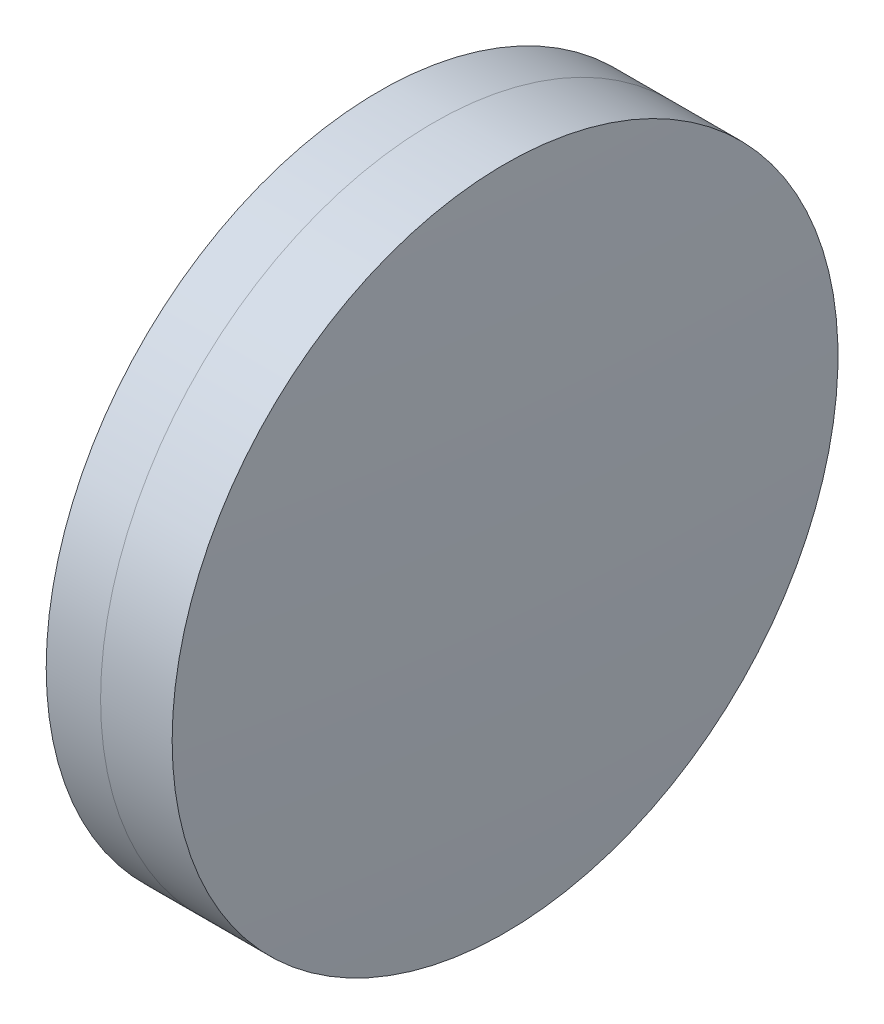
ISO-10303-21;
HEADER;
FILE_DESCRIPTION(('STEP AP214'),'2;1');
FILE_NAME('part.step','',(''),(''),'','','');
FILE_SCHEMA(('AUTOMOTIVE_DESIGN { 1 0 10303 214 1 1 1 1 }'));
ENDSEC;
DATA;
#1=APPLICATION_CONTEXT('core data for automotive mechanical design processes');
#2=APPLICATION_PROTOCOL_DEFINITION('international standard','automotive_design',2000,#1);
#3=PRODUCT_CONTEXT('',#1,'mechanical');
#4=PRODUCT('Part','Part','',(#3));
#5=PRODUCT_RELATED_PRODUCT_CATEGORY('part','',(#4));
#6=PRODUCT_DEFINITION_FORMATION('','',#4);
#7=PRODUCT_DEFINITION_CONTEXT('part definition',#1,'design');
#8=PRODUCT_DEFINITION('design','',#6,#7);
#9=PRODUCT_DEFINITION_SHAPE('','',#8);
#10=(LENGTH_UNIT() NAMED_UNIT(*) SI_UNIT(.MILLI.,.METRE.));
#11=(NAMED_UNIT(*) PLANE_ANGLE_UNIT() SI_UNIT($,.RADIAN.));
#12=(NAMED_UNIT(*) SI_UNIT($,.STERADIAN.) SOLID_ANGLE_UNIT());
#13=UNCERTAINTY_MEASURE_WITH_UNIT(LENGTH_MEASURE(1.E-05),#10,'distance_accuracy_value','');
#14=(GEOMETRIC_REPRESENTATION_CONTEXT(3) GLOBAL_UNCERTAINTY_ASSIGNED_CONTEXT((#13)) GLOBAL_UNIT_ASSIGNED_CONTEXT((#10,
#11,#12)) REPRESENTATION_CONTEXT('',''));
#15=CARTESIAN_POINT('',(0.,0.,0.));
#16=DIRECTION('',(0.,0.,1.));
#17=DIRECTION('',(1.,0.,0.));
#18=AXIS2_PLACEMENT_3D('',#15,#16,#17);
#19=CARTESIAN_POINT('',(14.8796689735747,0.,0.));
#20=DIRECTION('',(-1.,0.,0.));
#21=DIRECTION('',(0.,0.,1.));
#22=AXIS2_PLACEMENT_3D('',#19,#20,#21);
#23=SPHERICAL_SURFACE('',#22,80.015);
#24=CARTESIAN_POINT('',(93.9122586122801,0.,0.));
#25=DIRECTION('',(-1.,0.,0.));
#26=DIRECTION('',(0.,0.,1.));
#27=AXIS2_PLACEMENT_3D('',#24,#25,#26);
#28=CIRCLE('',#27,12.5000000000001);
#29=CARTESIAN_POINT('',(93.9122586122801,0.,12.5000000000001));
#30=VERTEX_POINT('',#29);
#31=EDGE_CURVE('E11',#30,#30,#28,.T.);
#32=ORIENTED_EDGE('',*,*,#31,.T.);
#33=EDGE_LOOP('',(#32));
#34=FACE_BOUND('',#33,.T.);
#35=ADVANCED_FACE('F53',(#34),#23,.F.);
#36=CARTESIAN_POINT('',(-0.551919992657797,0.,0.));
#37=DIRECTION('',(-1.,0.,0.));
#38=DIRECTION('',(0.,0.,1.));
#39=AXIS2_PLACEMENT_3D('',#36,#37,#38);
#40=CYLINDRICAL_SURFACE('',#39,12.5);
#41=CARTESIAN_POINT('',(96.5993254062926,0.,0.));
#42=DIRECTION('',(-1.,0.,0.));
#43=DIRECTION('',(0.,0.,1.));
#44=AXIS2_PLACEMENT_3D('',#41,#42,#43);
#45=CIRCLE('',#44,12.4999999999999);
#46=CARTESIAN_POINT('',(96.5993254062926,0.,12.4999999999999));
#47=VERTEX_POINT('',#46);
#48=EDGE_CURVE('E60',#47,#47,#45,.T.);
#49=ORIENTED_EDGE('',*,*,#48,.T.);
#50=EDGE_LOOP('',(#49));
#51=FACE_BOUND('',#50,.T.);
#52=ORIENTED_EDGE('',*,*,#31,.F.);
#53=EDGE_LOOP('',(#52));
#54=FACE_BOUND('',#53,.T.);
#55=ADVANCED_FACE('F67',(#51,#54),#40,.T.);
#56=CARTESIAN_POINT('',(-159.107331026425,0.,0.));
#57=DIRECTION('',(-1.,0.,0.));
#58=DIRECTION('',(0.,0.,1.));
#59=AXIS2_PLACEMENT_3D('',#56,#57,#58);
#60=SPHERICAL_SURFACE('',#59,256.012);
#61=ORIENTED_EDGE('',*,*,#48,.F.);
#62=EDGE_LOOP('',(#61));
#63=FACE_BOUND('',#62,.T.);
#64=ADVANCED_FACE('F70',(#63),#60,.T.);
#65=CLOSED_SHELL('',(#35,#55,#64));
#66=MANIFOLD_SOLID_BREP('B2',#65);
#67=CARTESIAN_POINT('',(216.444668973575,0.,0.));
#68=DIRECTION('',(-1.,0.,0.));
#69=DIRECTION('',(0.,0.,-1.));
#70=AXIS2_PLACEMENT_3D('',#67,#68,#69);
#71=SPHERICAL_SURFACE('',#70,125.2);
#72=CARTESIAN_POINT('',(91.8702333938781,0.,0.));
#73=DIRECTION('',(-1.,0.,0.));
#74=DIRECTION('',(0.,0.,1.));
#75=AXIS2_PLACEMENT_3D('',#72,#73,#74);
#76=CIRCLE('',#75,12.5);
#77=CARTESIAN_POINT('',(91.8702333938781,0.,12.5));
#78=VERTEX_POINT('',#77);
#79=EDGE_CURVE('E52',#78,#78,#76,.T.);
#80=ORIENTED_EDGE('',*,*,#79,.T.);
#81=EDGE_LOOP('',(#80));
#82=FACE_BOUND('',#81,.T.);
#83=ADVANCED_FACE('F101',(#82),#71,.T.);
#84=CARTESIAN_POINT('',(-9.70261217833668,0.,0.));
#85=DIRECTION('',(-1.,0.,0.));
#86=DIRECTION('',(0.,0.,1.));
#87=AXIS2_PLACEMENT_3D('',#84,#85,#86);
#88=CYLINDRICAL_SURFACE('',#87,12.5);
#89=CARTESIAN_POINT('',(93.9122586122801,0.,0.));
#90=DIRECTION('',(-1.,0.,0.));
#91=DIRECTION('',(0.,0.,1.));
#92=AXIS2_PLACEMENT_3D('',#89,#90,#91);
#93=CIRCLE('',#92,12.5);
#94=CARTESIAN_POINT('',(93.9122586122801,0.,12.5));
#95=VERTEX_POINT('',#94);
#96=EDGE_CURVE('E108',#95,#95,#93,.T.);
#97=ORIENTED_EDGE('',*,*,#96,.T.);
#98=EDGE_LOOP('',(#97));
#99=FACE_BOUND('',#98,.T.);
#100=ORIENTED_EDGE('',*,*,#79,.F.);
#101=EDGE_LOOP('',(#100));
#102=FACE_BOUND('',#101,.T.);
#103=ADVANCED_FACE('F115',(#99,#102),#88,.T.);
#104=CARTESIAN_POINT('',(14.8796689735747,0.,0.));
#105=DIRECTION('',(-1.,0.,0.));
#106=DIRECTION('',(0.,0.,1.));
#107=AXIS2_PLACEMENT_3D('',#104,#105,#106);
#108=SPHERICAL_SURFACE('',#107,80.015);
#109=ORIENTED_EDGE('',*,*,#96,.F.);
#110=EDGE_LOOP('',(#109));
#111=FACE_BOUND('',#110,.T.);
#112=ADVANCED_FACE('F118',(#111),#108,.T.);
#113=CLOSED_SHELL('',(#83,#103,#112));
#114=MANIFOLD_SOLID_BREP('B6',#113);
#115=ADVANCED_BREP_SHAPE_REPRESENTATION('',(#18,#66,#114),#14);
#116=SHAPE_DEFINITION_REPRESENTATION(#9,#115);
ENDSEC;
END-ISO-10303-21;
